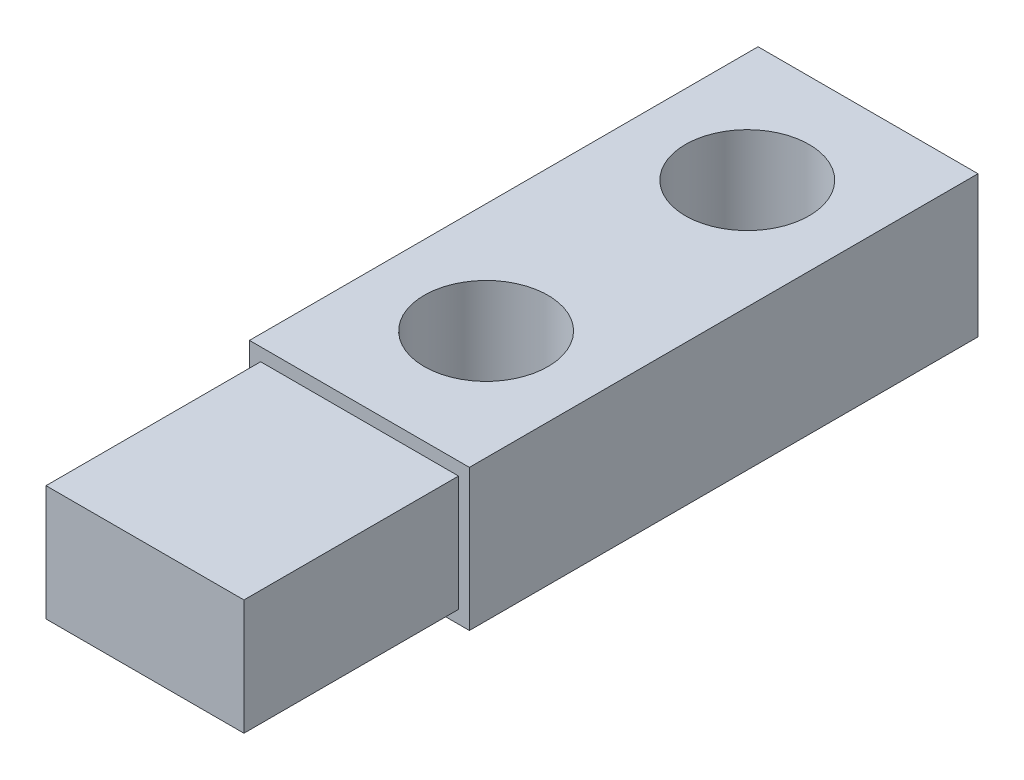
ISO-10303-21;
HEADER;
FILE_DESCRIPTION(('STEP AP214'),'2;1');
FILE_NAME('part.step','',(''),(''),'','','');
FILE_SCHEMA(('AUTOMOTIVE_DESIGN { 1 0 10303 214 1 1 1 1 }'));
ENDSEC;
DATA;
#1=APPLICATION_CONTEXT('core data for automotive mechanical design processes');
#2=APPLICATION_PROTOCOL_DEFINITION('international standard','automotive_design',2000,#1);
#3=PRODUCT_CONTEXT('',#1,'mechanical');
#4=PRODUCT('Part','Part','',(#3));
#5=PRODUCT_RELATED_PRODUCT_CATEGORY('part','',(#4));
#6=PRODUCT_DEFINITION_FORMATION('','',#4);
#7=PRODUCT_DEFINITION_CONTEXT('part definition',#1,'design');
#8=PRODUCT_DEFINITION('design','',#6,#7);
#9=PRODUCT_DEFINITION_SHAPE('','',#8);
#10=(LENGTH_UNIT() NAMED_UNIT(*) SI_UNIT(.MILLI.,.METRE.));
#11=(NAMED_UNIT(*) PLANE_ANGLE_UNIT() SI_UNIT($,.RADIAN.));
#12=(NAMED_UNIT(*) SI_UNIT($,.STERADIAN.) SOLID_ANGLE_UNIT());
#13=UNCERTAINTY_MEASURE_WITH_UNIT(LENGTH_MEASURE(1.E-05),#10,'distance_accuracy_value','');
#14=(GEOMETRIC_REPRESENTATION_CONTEXT(3) GLOBAL_UNCERTAINTY_ASSIGNED_CONTEXT((#13)) GLOBAL_UNIT_ASSIGNED_CONTEXT((#10,
#11,#12)) REPRESENTATION_CONTEXT('',''));
#15=CARTESIAN_POINT('',(0.,0.,0.));
#16=DIRECTION('',(0.,0.,1.));
#17=DIRECTION('',(1.,0.,0.));
#18=AXIS2_PLACEMENT_3D('',#15,#16,#17);
#19=CARTESIAN_POINT('',(0.,5.14,7.86132764835126));
#20=DIRECTION('',(0.,0.,-1.));
#21=DIRECTION('',(-1.,0.,0.));
#22=AXIS2_PLACEMENT_3D('',#19,#20,#21);
#23=PLANE('',#22);
#24=DIRECTION('',(1.,0.,0.));
#25=VECTOR('',#24,1.);
#26=CARTESIAN_POINT('',(0.,0.,7.86132764835126));
#27=LINE('',#26,#25);
#28=CARTESIAN_POINT('',(-4.2059697979018,0.,7.86132764835126));
#29=VERTEX_POINT('',#28);
#30=CARTESIAN_POINT('',(3.79403020209819,0.,7.86132764835126));
#31=VERTEX_POINT('',#30);
#32=EDGE_CURVE('E168',#29,#31,#27,.T.);
#33=ORIENTED_EDGE('',*,*,#32,.T.);
#34=DIRECTION('',(0.,-1.,0.));
#35=VECTOR('',#34,1.);
#36=CARTESIAN_POINT('',(3.79403020209819,5.14,7.86132764835126));
#37=LINE('',#36,#35);
#38=CARTESIAN_POINT('',(3.79403020209819,5.14,7.86132764835126));
#39=VERTEX_POINT('',#38);
#40=EDGE_CURVE('E79',#39,#31,#37,.T.);
#41=ORIENTED_EDGE('',*,*,#40,.F.);
#42=DIRECTION('',(1.,0.,0.));
#43=VECTOR('',#42,1.);
#44=CARTESIAN_POINT('',(0.,5.14,7.86132764835126));
#45=LINE('',#44,#43);
#46=CARTESIAN_POINT('',(-4.2059697979018,5.14,7.86132764835126));
#47=VERTEX_POINT('',#46);
#48=EDGE_CURVE('E59',#47,#39,#45,.T.);
#49=ORIENTED_EDGE('',*,*,#48,.F.);
#50=DIRECTION('',(0.,-1.,0.));
#51=VECTOR('',#50,1.);
#52=CARTESIAN_POINT('',(-4.2059697979018,5.14,7.86132764835126));
#53=LINE('',#52,#51);
#54=EDGE_CURVE('E176',#47,#29,#53,.T.);
#55=ORIENTED_EDGE('',*,*,#54,.T.);
#56=EDGE_LOOP('',(#33,#41,#49,#55));
#57=FACE_BOUND('',#56,.T.);
#58=DIRECTION('',(1.,0.,0.));
#59=VECTOR('',#58,1.);
#60=CARTESIAN_POINT('',(0.,0.47,7.86132764835126));
#61=LINE('',#60,#59);
#62=CARTESIAN_POINT('',(-3.8,0.47,7.86132764835126));
#63=VERTEX_POINT('',#62);
#64=CARTESIAN_POINT('',(3.4,0.47,7.86132764835126));
#65=VERTEX_POINT('',#64);
#66=EDGE_CURVE('E50',#63,#65,#61,.T.);
#67=ORIENTED_EDGE('',*,*,#66,.F.);
#68=DIRECTION('',(0.,-1.,0.));
#69=VECTOR('',#68,1.);
#70=CARTESIAN_POINT('',(-3.8,4.67,7.86132764835126));
#71=LINE('',#70,#69);
#72=CARTESIAN_POINT('',(-3.8,4.67,7.86132764835126));
#73=VERTEX_POINT('',#72);
#74=EDGE_CURVE('E134',#73,#63,#71,.T.);
#75=ORIENTED_EDGE('',*,*,#74,.F.);
#76=DIRECTION('',(1.,0.,0.));
#77=VECTOR('',#76,1.);
#78=CARTESIAN_POINT('',(0.,4.67,7.86132764835126));
#79=LINE('',#78,#77);
#80=CARTESIAN_POINT('',(3.4,4.67,7.86132764835126));
#81=VERTEX_POINT('',#80);
#82=EDGE_CURVE('E124',#73,#81,#79,.T.);
#83=ORIENTED_EDGE('',*,*,#82,.T.);
#84=DIRECTION('',(0.,-1.,0.));
#85=VECTOR('',#84,1.);
#86=CARTESIAN_POINT('',(3.4,4.67,7.86132764835126));
#87=LINE('',#86,#85);
#88=EDGE_CURVE('E142',#81,#65,#87,.T.);
#89=ORIENTED_EDGE('',*,*,#88,.T.);
#90=EDGE_LOOP('',(#67,#75,#83,#89));
#91=FACE_BOUND('',#90,.T.);
#92=ADVANCED_FACE('F35',(#57,#91),#23,.F.);
#93=CARTESIAN_POINT('',(3.79403020209819,5.14,0.));
#94=DIRECTION('',(1.,0.,0.));
#95=DIRECTION('',(0.,0.,-1.));
#96=AXIS2_PLACEMENT_3D('',#93,#94,#95);
#97=PLANE('',#96);
#98=DIRECTION('',(0.,0.,1.));
#99=VECTOR('',#98,1.);
#100=CARTESIAN_POINT('',(3.79403020209819,0.,0.));
#101=LINE('',#100,#99);
#102=CARTESIAN_POINT('',(3.79403020209819,0.,-10.6386723516487));
#103=VERTEX_POINT('',#102);
#104=EDGE_CURVE('E116',#103,#31,#101,.T.);
#105=ORIENTED_EDGE('',*,*,#104,.F.);
#106=DIRECTION('',(0.,-1.,0.));
#107=VECTOR('',#106,1.);
#108=CARTESIAN_POINT('',(3.79403020209819,5.14,-10.6386723516487));
#109=LINE('',#108,#107);
#110=CARTESIAN_POINT('',(3.79403020209819,5.14,-10.6386723516487));
#111=VERTEX_POINT('',#110);
#112=EDGE_CURVE('E11',#111,#103,#109,.T.);
#113=ORIENTED_EDGE('',*,*,#112,.F.);
#114=DIRECTION('',(0.,0.,1.));
#115=VECTOR('',#114,1.);
#116=CARTESIAN_POINT('',(3.79403020209819,5.14,0.));
#117=LINE('',#116,#115);
#118=EDGE_CURVE('E146',#111,#39,#117,.T.);
#119=ORIENTED_EDGE('',*,*,#118,.T.);
#120=ORIENTED_EDGE('',*,*,#40,.T.);
#121=EDGE_LOOP('',(#105,#113,#119,#120));
#122=FACE_BOUND('',#121,.T.);
#123=ADVANCED_FACE('F37',(#122),#97,.T.);
#124=CARTESIAN_POINT('',(0.,5.14,-10.6386723516487));
#125=DIRECTION('',(0.,0.,-1.));
#126=DIRECTION('',(-1.,0.,0.));
#127=AXIS2_PLACEMENT_3D('',#124,#125,#126);
#128=PLANE('',#127);
#129=DIRECTION('',(1.,0.,0.));
#130=VECTOR('',#129,1.);
#131=CARTESIAN_POINT('',(0.,0.,-10.6386723516487));
#132=LINE('',#131,#130);
#133=CARTESIAN_POINT('',(-4.2059697979018,0.,-10.6386723516487));
#134=VERTEX_POINT('',#133);
#135=EDGE_CURVE('E163',#134,#103,#132,.T.);
#136=ORIENTED_EDGE('',*,*,#135,.F.);
#137=DIRECTION('',(0.,-1.,0.));
#138=VECTOR('',#137,1.);
#139=CARTESIAN_POINT('',(-4.2059697979018,5.14,-10.6386723516487));
#140=LINE('',#139,#138);
#141=CARTESIAN_POINT('',(-4.2059697979018,5.14,-10.6386723516487));
#142=VERTEX_POINT('',#141);
#143=EDGE_CURVE('E43',#142,#134,#140,.T.);
#144=ORIENTED_EDGE('',*,*,#143,.F.);
#145=DIRECTION('',(1.,0.,0.));
#146=VECTOR('',#145,1.);
#147=CARTESIAN_POINT('',(0.,5.14,-10.6386723516487));
#148=LINE('',#147,#146);
#149=EDGE_CURVE('E148',#142,#111,#148,.T.);
#150=ORIENTED_EDGE('',*,*,#149,.T.);
#151=ORIENTED_EDGE('',*,*,#112,.T.);
#152=EDGE_LOOP('',(#136,#144,#150,#151));
#153=FACE_BOUND('',#152,.T.);
#154=ADVANCED_FACE('F190',(#153),#128,.T.);
#155=CARTESIAN_POINT('',(-4.2059697979018,5.14,0.));
#156=DIRECTION('',(1.,0.,0.));
#157=DIRECTION('',(0.,0.,-1.));
#158=AXIS2_PLACEMENT_3D('',#155,#156,#157);
#159=PLANE('',#158);
#160=DIRECTION('',(0.,0.,1.));
#161=VECTOR('',#160,1.);
#162=CARTESIAN_POINT('',(-4.2059697979018,0.,0.));
#163=LINE('',#162,#161);
#164=EDGE_CURVE('E166',#134,#29,#163,.T.);
#165=ORIENTED_EDGE('',*,*,#164,.T.);
#166=ORIENTED_EDGE('',*,*,#54,.F.);
#167=DIRECTION('',(0.,0.,1.));
#168=VECTOR('',#167,1.);
#169=CARTESIAN_POINT('',(-4.2059697979018,5.14,0.));
#170=LINE('',#169,#168);
#171=EDGE_CURVE('E152',#142,#47,#170,.T.);
#172=ORIENTED_EDGE('',*,*,#171,.F.);
#173=ORIENTED_EDGE('',*,*,#143,.T.);
#174=EDGE_LOOP('',(#165,#166,#172,#173));
#175=FACE_BOUND('',#174,.T.);
#176=ADVANCED_FACE('F181',(#175),#159,.F.);
#177=CARTESIAN_POINT('',(-0.2,5.14,3.25974881020002));
#178=DIRECTION('',(0.,-1.,0.));
#179=DIRECTION('',(0.,0.,-1.));
#180=AXIS2_PLACEMENT_3D('',#177,#178,#179);
#181=CYLINDRICAL_SURFACE('',#180,2.25);
#182=CARTESIAN_POINT('',(-0.2,5.14,3.25974881020002));
#183=DIRECTION('',(0.,1.,0.));
#184=DIRECTION('',(0.,0.,1.));
#185=AXIS2_PLACEMENT_3D('',#182,#183,#184);
#186=CIRCLE('',#185,2.25);
#187=CARTESIAN_POINT('',(-0.2,5.14,5.50974881020002));
#188=VERTEX_POINT('',#187);
#189=EDGE_CURVE('E155',#188,#188,#186,.T.);
#190=ORIENTED_EDGE('',*,*,#189,.T.);
#191=EDGE_LOOP('',(#190));
#192=FACE_BOUND('',#191,.T.);
#193=CARTESIAN_POINT('',(-0.2,0.,3.25974881020002));
#194=DIRECTION('',(0.,1.,0.));
#195=DIRECTION('',(0.,0.,1.));
#196=AXIS2_PLACEMENT_3D('',#193,#194,#195);
#197=CIRCLE('',#196,2.25);
#198=CARTESIAN_POINT('',(-0.2,0.,5.50974881020002));
#199=VERTEX_POINT('',#198);
#200=EDGE_CURVE('E170',#199,#199,#197,.T.);
#201=ORIENTED_EDGE('',*,*,#200,.F.);
#202=EDGE_LOOP('',(#201));
#203=FACE_BOUND('',#202,.T.);
#204=ADVANCED_FACE('F203',(#192,#203),#181,.F.);
#205=CARTESIAN_POINT('',(-0.2,5.14,-6.24025118979998));
#206=DIRECTION('',(0.,-1.,0.));
#207=DIRECTION('',(0.,0.,-1.));
#208=AXIS2_PLACEMENT_3D('',#205,#206,#207);
#209=CYLINDRICAL_SURFACE('',#208,2.25);
#210=CARTESIAN_POINT('',(-0.2,5.14,-6.24025118979998));
#211=DIRECTION('',(0.,1.,0.));
#212=DIRECTION('',(0.,0.,1.));
#213=AXIS2_PLACEMENT_3D('',#210,#211,#212);
#214=CIRCLE('',#213,2.25);
#215=CARTESIAN_POINT('',(-0.2,5.14,-3.99025118979998));
#216=VERTEX_POINT('',#215);
#217=EDGE_CURVE('E158',#216,#216,#214,.F.);
#218=ORIENTED_EDGE('',*,*,#217,.F.);
#219=EDGE_LOOP('',(#218));
#220=FACE_BOUND('',#219,.T.);
#221=CARTESIAN_POINT('',(-0.2,0.,-6.24025118979998));
#222=DIRECTION('',(0.,1.,0.));
#223=DIRECTION('',(0.,0.,1.));
#224=AXIS2_PLACEMENT_3D('',#221,#222,#223);
#225=CIRCLE('',#224,2.25);
#226=CARTESIAN_POINT('',(-0.2,0.,-3.99025118979998));
#227=VERTEX_POINT('',#226);
#228=EDGE_CURVE('E149',#227,#227,#225,.F.);
#229=ORIENTED_EDGE('',*,*,#228,.T.);
#230=EDGE_LOOP('',(#229));
#231=FACE_BOUND('',#230,.T.);
#232=ADVANCED_FACE('F209',(#220,#231),#209,.F.);
#233=CARTESIAN_POINT('',(0.,5.14,0.));
#234=DIRECTION('',(0.,1.,0.));
#235=DIRECTION('',(0.,0.,1.));
#236=AXIS2_PLACEMENT_3D('',#233,#234,#235);
#237=PLANE('',#236);
#238=ORIENTED_EDGE('',*,*,#118,.F.);
#239=ORIENTED_EDGE('',*,*,#149,.F.);
#240=ORIENTED_EDGE('',*,*,#171,.T.);
#241=ORIENTED_EDGE('',*,*,#48,.T.);
#242=EDGE_LOOP('',(#238,#239,#240,#241));
#243=FACE_BOUND('',#242,.T.);
#244=ORIENTED_EDGE('',*,*,#189,.F.);
#245=EDGE_LOOP('',(#244));
#246=FACE_BOUND('',#245,.T.);
#247=ORIENTED_EDGE('',*,*,#217,.T.);
#248=EDGE_LOOP('',(#247));
#249=FACE_BOUND('',#248,.T.);
#250=ADVANCED_FACE('F214',(#243,#246,#249),#237,.T.);
#251=CARTESIAN_POINT('',(0.,0.,0.));
#252=DIRECTION('',(0.,1.,0.));
#253=DIRECTION('',(0.,0.,1.));
#254=AXIS2_PLACEMENT_3D('',#251,#252,#253);
#255=PLANE('',#254);
#256=ORIENTED_EDGE('',*,*,#104,.T.);
#257=ORIENTED_EDGE('',*,*,#32,.F.);
#258=ORIENTED_EDGE('',*,*,#164,.F.);
#259=ORIENTED_EDGE('',*,*,#135,.T.);
#260=EDGE_LOOP('',(#256,#257,#258,#259));
#261=FACE_BOUND('',#260,.T.);
#262=ORIENTED_EDGE('',*,*,#200,.T.);
#263=EDGE_LOOP('',(#262));
#264=FACE_BOUND('',#263,.T.);
#265=ORIENTED_EDGE('',*,*,#228,.F.);
#266=EDGE_LOOP('',(#265));
#267=FACE_BOUND('',#266,.T.);
#268=ADVANCED_FACE('F188',(#261,#264,#267),#255,.F.);
#269=CARTESIAN_POINT('',(-3.8,4.67,0.));
#270=DIRECTION('',(-1.,0.,0.));
#271=DIRECTION('',(0.,0.,1.));
#272=AXIS2_PLACEMENT_3D('',#269,#270,#271);
#273=PLANE('',#272);
#274=DIRECTION('',(0.,0.,-1.));
#275=VECTOR('',#274,1.);
#276=CARTESIAN_POINT('',(-3.8,0.47,0.));
#277=LINE('',#276,#275);
#278=CARTESIAN_POINT('',(-3.8,0.47,15.6679820853427));
#279=VERTEX_POINT('',#278);
#280=EDGE_CURVE('E111',#279,#63,#277,.T.);
#281=ORIENTED_EDGE('',*,*,#280,.F.);
#282=DIRECTION('',(0.,-1.,0.));
#283=VECTOR('',#282,1.);
#284=CARTESIAN_POINT('',(-3.8,4.67,15.6679820853427));
#285=LINE('',#284,#283);
#286=CARTESIAN_POINT('',(-3.8,4.67,15.6679820853427));
#287=VERTEX_POINT('',#286);
#288=EDGE_CURVE('E106',#287,#279,#285,.T.);
#289=ORIENTED_EDGE('',*,*,#288,.F.);
#290=DIRECTION('',(0.,0.,-1.));
#291=VECTOR('',#290,1.);
#292=CARTESIAN_POINT('',(-3.8,4.67,0.));
#293=LINE('',#292,#291);
#294=EDGE_CURVE('E109',#287,#73,#293,.T.);
#295=ORIENTED_EDGE('',*,*,#294,.T.);
#296=ORIENTED_EDGE('',*,*,#74,.T.);
#297=EDGE_LOOP('',(#281,#289,#295,#296));
#298=FACE_BOUND('',#297,.T.);
#299=ADVANCED_FACE('F108',(#298),#273,.T.);
#300=CARTESIAN_POINT('',(0.,4.67,15.6679820853427));
#301=DIRECTION('',(0.,0.,1.));
#302=DIRECTION('',(1.,0.,0.));
#303=AXIS2_PLACEMENT_3D('',#300,#301,#302);
#304=PLANE('',#303);
#305=DIRECTION('',(-1.,0.,0.));
#306=VECTOR('',#305,1.);
#307=CARTESIAN_POINT('',(0.,0.47,15.6679820853427));
#308=LINE('',#307,#306);
#309=CARTESIAN_POINT('',(3.4,0.47,15.6679820853427));
#310=VERTEX_POINT('',#309);
#311=EDGE_CURVE('E136',#310,#279,#308,.T.);
#312=ORIENTED_EDGE('',*,*,#311,.F.);
#313=DIRECTION('',(0.,-1.,0.));
#314=VECTOR('',#313,1.);
#315=CARTESIAN_POINT('',(3.4,4.67,15.6679820853427));
#316=LINE('',#315,#314);
#317=CARTESIAN_POINT('',(3.4,4.67,15.6679820853427));
#318=VERTEX_POINT('',#317);
#319=EDGE_CURVE('E117',#318,#310,#316,.T.);
#320=ORIENTED_EDGE('',*,*,#319,.F.);
#321=DIRECTION('',(-1.,0.,0.));
#322=VECTOR('',#321,1.);
#323=CARTESIAN_POINT('',(0.,4.67,15.6679820853427));
#324=LINE('',#323,#322);
#325=EDGE_CURVE('E122',#318,#287,#324,.T.);
#326=ORIENTED_EDGE('',*,*,#325,.T.);
#327=ORIENTED_EDGE('',*,*,#288,.T.);
#328=EDGE_LOOP('',(#312,#320,#326,#327));
#329=FACE_BOUND('',#328,.T.);
#330=ADVANCED_FACE('F127',(#329),#304,.T.);
#331=CARTESIAN_POINT('',(3.4,4.67,0.));
#332=DIRECTION('',(-1.,0.,0.));
#333=DIRECTION('',(0.,0.,1.));
#334=AXIS2_PLACEMENT_3D('',#331,#332,#333);
#335=PLANE('',#334);
#336=DIRECTION('',(0.,0.,-1.));
#337=VECTOR('',#336,1.);
#338=CARTESIAN_POINT('',(3.4,0.47,0.));
#339=LINE('',#338,#337);
#340=EDGE_CURVE('E138',#310,#65,#339,.T.);
#341=ORIENTED_EDGE('',*,*,#340,.T.);
#342=ORIENTED_EDGE('',*,*,#88,.F.);
#343=DIRECTION('',(0.,0.,-1.));
#344=VECTOR('',#343,1.);
#345=CARTESIAN_POINT('',(3.4,4.67,0.));
#346=LINE('',#345,#344);
#347=EDGE_CURVE('E129',#318,#81,#346,.T.);
#348=ORIENTED_EDGE('',*,*,#347,.F.);
#349=ORIENTED_EDGE('',*,*,#319,.T.);
#350=EDGE_LOOP('',(#341,#342,#348,#349));
#351=FACE_BOUND('',#350,.T.);
#352=ADVANCED_FACE('F233',(#351),#335,.F.);
#353=CARTESIAN_POINT('',(0.,4.67,0.));
#354=DIRECTION('',(0.,1.,0.));
#355=DIRECTION('',(0.,0.,1.));
#356=AXIS2_PLACEMENT_3D('',#353,#354,#355);
#357=PLANE('',#356);
#358=ORIENTED_EDGE('',*,*,#294,.F.);
#359=ORIENTED_EDGE('',*,*,#325,.F.);
#360=ORIENTED_EDGE('',*,*,#347,.T.);
#361=ORIENTED_EDGE('',*,*,#82,.F.);
#362=EDGE_LOOP('',(#358,#359,#360,#361));
#363=FACE_BOUND('',#362,.T.);
#364=ADVANCED_FACE('F121',(#363),#357,.T.);
#365=CARTESIAN_POINT('',(0.,0.47,0.));
#366=DIRECTION('',(0.,1.,0.));
#367=DIRECTION('',(0.,0.,1.));
#368=AXIS2_PLACEMENT_3D('',#365,#366,#367);
#369=PLANE('',#368);
#370=ORIENTED_EDGE('',*,*,#280,.T.);
#371=ORIENTED_EDGE('',*,*,#66,.T.);
#372=ORIENTED_EDGE('',*,*,#340,.F.);
#373=ORIENTED_EDGE('',*,*,#311,.T.);
#374=EDGE_LOOP('',(#370,#371,#372,#373));
#375=FACE_BOUND('',#374,.T.);
#376=ADVANCED_FACE('F237',(#375),#369,.F.);
#377=CLOSED_SHELL('',(#92,#123,#154,#176,#204,#232,#250,#268,#299,#330,#352,#364,#376));
#378=MANIFOLD_SOLID_BREP('B2',#377);
#379=ADVANCED_BREP_SHAPE_REPRESENTATION('',(#18,#378),#14);
#380=SHAPE_DEFINITION_REPRESENTATION(#9,#379);
ENDSEC;
END-ISO-10303-21;
